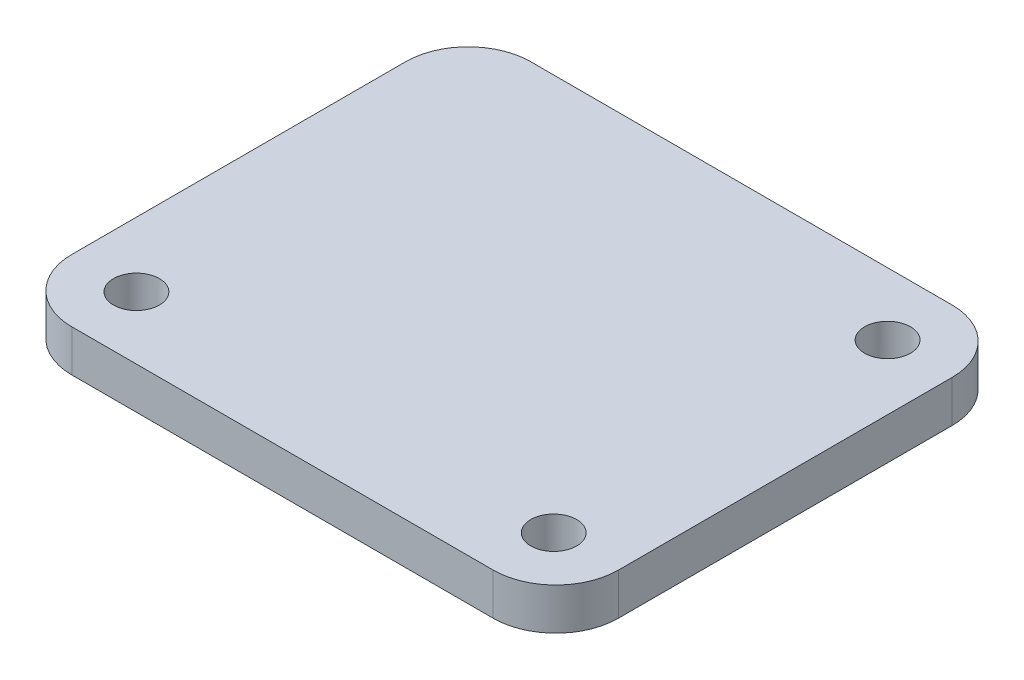
ISO-10303-21;
HEADER;
FILE_DESCRIPTION(('STEP AP214'),'2;1');
FILE_NAME('part.step','',(''),(''),'','','');
FILE_SCHEMA(('AUTOMOTIVE_DESIGN { 1 0 10303 214 1 1 1 1 }'));
ENDSEC;
DATA;
#1=APPLICATION_CONTEXT('core data for automotive mechanical design processes');
#2=APPLICATION_PROTOCOL_DEFINITION('international standard','automotive_design',2000,#1);
#3=PRODUCT_CONTEXT('',#1,'mechanical');
#4=PRODUCT('Part','Part','',(#3));
#5=PRODUCT_RELATED_PRODUCT_CATEGORY('part','',(#4));
#6=PRODUCT_DEFINITION_FORMATION('','',#4);
#7=PRODUCT_DEFINITION_CONTEXT('part definition',#1,'design');
#8=PRODUCT_DEFINITION('design','',#6,#7);
#9=PRODUCT_DEFINITION_SHAPE('','',#8);
#10=(LENGTH_UNIT() NAMED_UNIT(*) SI_UNIT(.MILLI.,.METRE.));
#11=(NAMED_UNIT(*) PLANE_ANGLE_UNIT() SI_UNIT($,.RADIAN.));
#12=(NAMED_UNIT(*) SI_UNIT($,.STERADIAN.) SOLID_ANGLE_UNIT());
#13=UNCERTAINTY_MEASURE_WITH_UNIT(LENGTH_MEASURE(1.E-05),#10,'distance_accuracy_value','');
#14=(GEOMETRIC_REPRESENTATION_CONTEXT(3) GLOBAL_UNCERTAINTY_ASSIGNED_CONTEXT((#13)) GLOBAL_UNIT_ASSIGNED_CONTEXT((#10,
#11,#12)) REPRESENTATION_CONTEXT('',''));
#15=CARTESIAN_POINT('',(0.,0.,0.));
#16=DIRECTION('',(0.,0.,1.));
#17=DIRECTION('',(1.,0.,0.));
#18=AXIS2_PLACEMENT_3D('',#15,#16,#17);
#19=CARTESIAN_POINT('',(16.637,2.54,13.97));
#20=DIRECTION('',(-1.,0.,0.));
#21=DIRECTION('',(0.,0.,1.));
#22=AXIS2_PLACEMENT_3D('',#19,#20,#21);
#23=PLANE('',#22);
#24=DIRECTION('',(0.,0.,-1.));
#25=VECTOR('',#24,1.);
#26=CARTESIAN_POINT('',(16.637,2.54,13.97));
#27=LINE('',#26,#25);
#28=CARTESIAN_POINT('',(16.637,2.54,10.16));
#29=VERTEX_POINT('',#28);
#30=CARTESIAN_POINT('',(16.637,2.54,-10.16));
#31=VERTEX_POINT('',#30);
#32=EDGE_CURVE('E131',#29,#31,#27,.T.);
#33=ORIENTED_EDGE('',*,*,#32,.F.);
#34=DIRECTION('',(0.,-1.,0.));
#35=VECTOR('',#34,1.);
#36=CARTESIAN_POINT('',(16.637,2.54,10.16));
#37=LINE('',#36,#35);
#38=CARTESIAN_POINT('',(16.637,0.,10.16));
#39=VERTEX_POINT('',#38);
#40=EDGE_CURVE('E157',#29,#39,#37,.T.);
#41=ORIENTED_EDGE('',*,*,#40,.T.);
#42=DIRECTION('',(0.,0.,-1.));
#43=VECTOR('',#42,1.);
#44=CARTESIAN_POINT('',(16.637,0.,13.97));
#45=LINE('',#44,#43);
#46=CARTESIAN_POINT('',(16.637,0.,-10.16));
#47=VERTEX_POINT('',#46);
#48=EDGE_CURVE('E163',#39,#47,#45,.T.);
#49=ORIENTED_EDGE('',*,*,#48,.T.);
#50=DIRECTION('',(0.,-1.,0.));
#51=VECTOR('',#50,1.);
#52=CARTESIAN_POINT('',(16.637,2.54,-10.16));
#53=LINE('',#52,#51);
#54=EDGE_CURVE('E155',#47,#31,#53,.F.);
#55=ORIENTED_EDGE('',*,*,#54,.T.);
#56=EDGE_LOOP('',(#33,#41,#49,#55));
#57=FACE_BOUND('',#56,.T.);
#58=ADVANCED_FACE('F39',(#57),#23,.F.);
#59=CARTESIAN_POINT('',(-16.637,2.54,-13.97));
#60=DIRECTION('',(0.,0.,1.));
#61=DIRECTION('',(1.,0.,0.));
#62=AXIS2_PLACEMENT_3D('',#59,#60,#61);
#63=PLANE('',#62);
#64=DIRECTION('',(-1.,0.,0.));
#65=VECTOR('',#64,1.);
#66=CARTESIAN_POINT('',(-16.637,2.54,-13.97));
#67=LINE('',#66,#65);
#68=CARTESIAN_POINT('',(12.827,2.54,-13.97));
#69=VERTEX_POINT('',#68);
#70=CARTESIAN_POINT('',(-12.827,2.54,-13.97));
#71=VERTEX_POINT('',#70);
#72=EDGE_CURVE('E134',#69,#71,#67,.T.);
#73=ORIENTED_EDGE('',*,*,#72,.F.);
#74=DIRECTION('',(0.,-1.,0.));
#75=VECTOR('',#74,1.);
#76=CARTESIAN_POINT('',(12.827,2.54,-13.97));
#77=LINE('',#76,#75);
#78=CARTESIAN_POINT('',(12.827,0.,-13.97));
#79=VERTEX_POINT('',#78);
#80=EDGE_CURVE('E11',#69,#79,#77,.T.);
#81=ORIENTED_EDGE('',*,*,#80,.T.);
#82=DIRECTION('',(-1.,0.,0.));
#83=VECTOR('',#82,1.);
#84=CARTESIAN_POINT('',(-16.637,0.,-13.97));
#85=LINE('',#84,#83);
#86=CARTESIAN_POINT('',(-12.827,0.,-13.97));
#87=VERTEX_POINT('',#86);
#88=EDGE_CURVE('E136',#79,#87,#85,.T.);
#89=ORIENTED_EDGE('',*,*,#88,.T.);
#90=DIRECTION('',(0.,-1.,0.));
#91=VECTOR('',#90,1.);
#92=CARTESIAN_POINT('',(-12.827,2.54,-13.97));
#93=LINE('',#92,#91);
#94=EDGE_CURVE('E47',#87,#71,#93,.F.);
#95=ORIENTED_EDGE('',*,*,#94,.T.);
#96=EDGE_LOOP('',(#73,#81,#89,#95));
#97=FACE_BOUND('',#96,.T.);
#98=ADVANCED_FACE('F211',(#97),#63,.F.);
#99=CARTESIAN_POINT('',(-16.637,2.54,13.97));
#100=DIRECTION('',(1.,0.,0.));
#101=DIRECTION('',(0.,0.,-1.));
#102=AXIS2_PLACEMENT_3D('',#99,#100,#101);
#103=PLANE('',#102);
#104=DIRECTION('',(0.,0.,1.));
#105=VECTOR('',#104,1.);
#106=CARTESIAN_POINT('',(-16.637,0.,13.97));
#107=LINE('',#106,#105);
#108=CARTESIAN_POINT('',(-16.637,0.,-10.16));
#109=VERTEX_POINT('',#108);
#110=CARTESIAN_POINT('',(-16.637,0.,10.16));
#111=VERTEX_POINT('',#110);
#112=EDGE_CURVE('E132',#109,#111,#107,.T.);
#113=ORIENTED_EDGE('',*,*,#112,.T.);
#114=DIRECTION('',(0.,-1.,0.));
#115=VECTOR('',#114,1.);
#116=CARTESIAN_POINT('',(-16.637,2.54,10.16));
#117=LINE('',#116,#115);
#118=CARTESIAN_POINT('',(-16.637,2.54,10.16));
#119=VERTEX_POINT('',#118);
#120=EDGE_CURVE('E110',#111,#119,#117,.F.);
#121=ORIENTED_EDGE('',*,*,#120,.T.);
#122=DIRECTION('',(0.,0.,1.));
#123=VECTOR('',#122,1.);
#124=CARTESIAN_POINT('',(-16.637,2.54,13.97));
#125=LINE('',#124,#123);
#126=CARTESIAN_POINT('',(-16.637,2.54,-10.16));
#127=VERTEX_POINT('',#126);
#128=EDGE_CURVE('E175',#127,#119,#125,.T.);
#129=ORIENTED_EDGE('',*,*,#128,.F.);
#130=DIRECTION('',(0.,-1.,0.));
#131=VECTOR('',#130,1.);
#132=CARTESIAN_POINT('',(-16.637,2.54,-10.16));
#133=LINE('',#132,#131);
#134=EDGE_CURVE('E115',#127,#109,#133,.T.);
#135=ORIENTED_EDGE('',*,*,#134,.T.);
#136=EDGE_LOOP('',(#113,#121,#129,#135));
#137=FACE_BOUND('',#136,.T.);
#138=ADVANCED_FACE('F216',(#137),#103,.F.);
#139=CARTESIAN_POINT('',(-16.637,2.54,13.97));
#140=DIRECTION('',(0.,0.,-1.));
#141=DIRECTION('',(-1.,0.,0.));
#142=AXIS2_PLACEMENT_3D('',#139,#140,#141);
#143=PLANE('',#142);
#144=DIRECTION('',(1.,0.,0.));
#145=VECTOR('',#144,1.);
#146=CARTESIAN_POINT('',(-16.637,2.54,13.97));
#147=LINE('',#146,#145);
#148=CARTESIAN_POINT('',(-12.827,2.54,13.97));
#149=VERTEX_POINT('',#148);
#150=CARTESIAN_POINT('',(12.827,2.54,13.97));
#151=VERTEX_POINT('',#150);
#152=EDGE_CURVE('E125',#149,#151,#147,.T.);
#153=ORIENTED_EDGE('',*,*,#152,.F.);
#154=DIRECTION('',(0.,-1.,0.));
#155=VECTOR('',#154,1.);
#156=CARTESIAN_POINT('',(-12.827,2.54,13.97));
#157=LINE('',#156,#155);
#158=CARTESIAN_POINT('',(-12.827,0.,13.97));
#159=VERTEX_POINT('',#158);
#160=EDGE_CURVE('E109',#149,#159,#157,.T.);
#161=ORIENTED_EDGE('',*,*,#160,.T.);
#162=DIRECTION('',(1.,0.,0.));
#163=VECTOR('',#162,1.);
#164=CARTESIAN_POINT('',(-16.637,0.,13.97));
#165=LINE('',#164,#163);
#166=CARTESIAN_POINT('',(12.827,0.,13.97));
#167=VERTEX_POINT('',#166);
#168=EDGE_CURVE('E122',#159,#167,#165,.T.);
#169=ORIENTED_EDGE('',*,*,#168,.T.);
#170=DIRECTION('',(0.,-1.,0.));
#171=VECTOR('',#170,1.);
#172=CARTESIAN_POINT('',(12.827,2.54,13.97));
#173=LINE('',#172,#171);
#174=EDGE_CURVE('E127',#167,#151,#173,.F.);
#175=ORIENTED_EDGE('',*,*,#174,.T.);
#176=EDGE_LOOP('',(#153,#161,#169,#175));
#177=FACE_BOUND('',#176,.T.);
#178=ADVANCED_FACE('F121',(#177),#143,.F.);
#179=CARTESIAN_POINT('',(0.,2.54,0.));
#180=DIRECTION('',(0.,-1.,0.));
#181=DIRECTION('',(0.,0.,-1.));
#182=AXIS2_PLACEMENT_3D('',#179,#180,#181);
#183=PLANE('',#182);
#184=CARTESIAN_POINT('',(12.6999999999999,2.54,-10.16));
#185=DIRECTION('',(0.,1.,0.));
#186=DIRECTION('',(0.,0.,1.));
#187=AXIS2_PLACEMENT_3D('',#184,#185,#186);
#188=CIRCLE('',#187,1.397);
#189=CARTESIAN_POINT('',(12.6999999999999,2.54,-8.763));
#190=VERTEX_POINT('',#189);
#191=EDGE_CURVE('E182',#190,#190,#188,.T.);
#192=ORIENTED_EDGE('',*,*,#191,.F.);
#193=EDGE_LOOP('',(#192));
#194=FACE_BOUND('',#193,.T.);
#195=CARTESIAN_POINT('',(-12.7,2.54,10.1600000000002));
#196=DIRECTION('',(0.,1.,0.));
#197=DIRECTION('',(0.,0.,1.));
#198=AXIS2_PLACEMENT_3D('',#195,#196,#197);
#199=CIRCLE('',#198,1.397);
#200=CARTESIAN_POINT('',(-12.7,2.54,11.5570000000002));
#201=VERTEX_POINT('',#200);
#202=EDGE_CURVE('E181',#201,#201,#199,.T.);
#203=ORIENTED_EDGE('',*,*,#202,.F.);
#204=EDGE_LOOP('',(#203));
#205=FACE_BOUND('',#204,.T.);
#206=CARTESIAN_POINT('',(12.7,2.54,10.16));
#207=DIRECTION('',(0.,1.,0.));
#208=DIRECTION('',(0.,0.,1.));
#209=AXIS2_PLACEMENT_3D('',#206,#207,#208);
#210=CIRCLE('',#209,1.397);
#211=CARTESIAN_POINT('',(12.7,2.54,11.557));
#212=VERTEX_POINT('',#211);
#213=EDGE_CURVE('E171',#212,#212,#210,.T.);
#214=ORIENTED_EDGE('',*,*,#213,.F.);
#215=EDGE_LOOP('',(#214));
#216=FACE_BOUND('',#215,.T.);
#217=ORIENTED_EDGE('',*,*,#128,.T.);
#218=CARTESIAN_POINT('',(-12.827,2.54,10.16));
#219=DIRECTION('',(0.,-1.,0.));
#220=DIRECTION('',(0.,0.,-1.));
#221=AXIS2_PLACEMENT_3D('',#218,#219,#220);
#222=CIRCLE('',#221,3.81);
#223=EDGE_CURVE('E153',#119,#149,#222,.F.);
#224=ORIENTED_EDGE('',*,*,#223,.T.);
#225=ORIENTED_EDGE('',*,*,#152,.T.);
#226=CARTESIAN_POINT('',(12.827,2.54,10.16));
#227=DIRECTION('',(0.,-1.,0.));
#228=DIRECTION('',(0.,0.,-1.));
#229=AXIS2_PLACEMENT_3D('',#226,#227,#228);
#230=CIRCLE('',#229,3.81);
#231=EDGE_CURVE('E151',#151,#29,#230,.F.);
#232=ORIENTED_EDGE('',*,*,#231,.T.);
#233=ORIENTED_EDGE('',*,*,#32,.T.);
#234=CARTESIAN_POINT('',(12.827,2.54,-10.16));
#235=DIRECTION('',(0.,-1.,0.));
#236=DIRECTION('',(0.,0.,-1.));
#237=AXIS2_PLACEMENT_3D('',#234,#235,#236);
#238=CIRCLE('',#237,3.81);
#239=EDGE_CURVE('E60',#31,#69,#238,.F.);
#240=ORIENTED_EDGE('',*,*,#239,.T.);
#241=ORIENTED_EDGE('',*,*,#72,.T.);
#242=CARTESIAN_POINT('',(-12.827,2.54,-10.16));
#243=DIRECTION('',(0.,-1.,0.));
#244=DIRECTION('',(0.,0.,-1.));
#245=AXIS2_PLACEMENT_3D('',#242,#243,#244);
#246=CIRCLE('',#245,3.81);
#247=EDGE_CURVE('E148',#71,#127,#246,.F.);
#248=ORIENTED_EDGE('',*,*,#247,.T.);
#249=EDGE_LOOP('',(#217,#224,#225,#232,#233,#240,#241,#248));
#250=FACE_BOUND('',#249,.T.);
#251=ADVANCED_FACE('F236',(#194,#205,#216,#250),#183,.F.);
#252=CARTESIAN_POINT('',(0.,0.,0.));
#253=DIRECTION('',(0.,-1.,0.));
#254=DIRECTION('',(0.,0.,-1.));
#255=AXIS2_PLACEMENT_3D('',#252,#253,#254);
#256=PLANE('',#255);
#257=CARTESIAN_POINT('',(12.6999999999999,0.,-10.16));
#258=DIRECTION('',(0.,-1.,0.));
#259=DIRECTION('',(0.,0.,-1.));
#260=AXIS2_PLACEMENT_3D('',#257,#258,#259);
#261=CIRCLE('',#260,1.397);
#262=CARTESIAN_POINT('',(12.6999999999999,0.,-11.557));
#263=VERTEX_POINT('',#262);
#264=EDGE_CURVE('E186',#263,#263,#261,.F.);
#265=ORIENTED_EDGE('',*,*,#264,.T.);
#266=EDGE_LOOP('',(#265));
#267=FACE_BOUND('',#266,.T.);
#268=CARTESIAN_POINT('',(-12.7,0.,10.1600000000002));
#269=DIRECTION('',(0.,-1.,0.));
#270=DIRECTION('',(0.,0.,-1.));
#271=AXIS2_PLACEMENT_3D('',#268,#269,#270);
#272=CIRCLE('',#271,1.397);
#273=CARTESIAN_POINT('',(-12.7,0.,8.76300000000018));
#274=VERTEX_POINT('',#273);
#275=EDGE_CURVE('E185',#274,#274,#272,.F.);
#276=ORIENTED_EDGE('',*,*,#275,.T.);
#277=EDGE_LOOP('',(#276));
#278=FACE_BOUND('',#277,.T.);
#279=CARTESIAN_POINT('',(12.7,0.,10.16));
#280=DIRECTION('',(0.,-1.,0.));
#281=DIRECTION('',(0.,0.,-1.));
#282=AXIS2_PLACEMENT_3D('',#279,#280,#281);
#283=CIRCLE('',#282,1.397);
#284=CARTESIAN_POINT('',(12.7,0.,8.763));
#285=VERTEX_POINT('',#284);
#286=EDGE_CURVE('E168',#285,#285,#283,.F.);
#287=ORIENTED_EDGE('',*,*,#286,.T.);
#288=EDGE_LOOP('',(#287));
#289=FACE_BOUND('',#288,.T.);
#290=ORIENTED_EDGE('',*,*,#168,.F.);
#291=CARTESIAN_POINT('',(-12.827,0.,10.16));
#292=DIRECTION('',(0.,-1.,0.));
#293=DIRECTION('',(0.,0.,-1.));
#294=AXIS2_PLACEMENT_3D('',#291,#292,#293);
#295=CIRCLE('',#294,3.81);
#296=EDGE_CURVE('E105',#159,#111,#295,.T.);
#297=ORIENTED_EDGE('',*,*,#296,.T.);
#298=ORIENTED_EDGE('',*,*,#112,.F.);
#299=CARTESIAN_POINT('',(-12.827,0.,-10.16));
#300=DIRECTION('',(0.,-1.,0.));
#301=DIRECTION('',(0.,0.,-1.));
#302=AXIS2_PLACEMENT_3D('',#299,#300,#301);
#303=CIRCLE('',#302,3.81);
#304=EDGE_CURVE('E126',#109,#87,#303,.T.);
#305=ORIENTED_EDGE('',*,*,#304,.T.);
#306=ORIENTED_EDGE('',*,*,#88,.F.);
#307=CARTESIAN_POINT('',(12.827,0.,-10.16));
#308=DIRECTION('',(0.,-1.,0.));
#309=DIRECTION('',(0.,0.,-1.));
#310=AXIS2_PLACEMENT_3D('',#307,#308,#309);
#311=CIRCLE('',#310,3.81);
#312=EDGE_CURVE('E142',#79,#47,#311,.T.);
#313=ORIENTED_EDGE('',*,*,#312,.T.);
#314=ORIENTED_EDGE('',*,*,#48,.F.);
#315=CARTESIAN_POINT('',(12.827,0.,10.16));
#316=DIRECTION('',(0.,-1.,0.));
#317=DIRECTION('',(0.,0.,-1.));
#318=AXIS2_PLACEMENT_3D('',#315,#316,#317);
#319=CIRCLE('',#318,3.81);
#320=EDGE_CURVE('E116',#39,#167,#319,.T.);
#321=ORIENTED_EDGE('',*,*,#320,.T.);
#322=EDGE_LOOP('',(#290,#297,#298,#305,#306,#313,#314,#321));
#323=FACE_BOUND('',#322,.T.);
#324=ADVANCED_FACE('F129',(#267,#278,#289,#323),#256,.T.);
#325=CARTESIAN_POINT('',(12.7,-3.95131269327043,10.16));
#326=DIRECTION('',(0.,1.,0.));
#327=DIRECTION('',(0.,0.,1.));
#328=AXIS2_PLACEMENT_3D('',#325,#326,#327);
#329=CYLINDRICAL_SURFACE('',#328,1.397);
#330=ORIENTED_EDGE('',*,*,#213,.T.);
#331=EDGE_LOOP('',(#330));
#332=FACE_BOUND('',#331,.T.);
#333=ORIENTED_EDGE('',*,*,#286,.F.);
#334=EDGE_LOOP('',(#333));
#335=FACE_BOUND('',#334,.T.);
#336=ADVANCED_FACE('F199',(#332,#335),#329,.F.);
#337=CARTESIAN_POINT('',(-12.7,-3.95131269327043,10.1600000000002));
#338=DIRECTION('',(0.,1.,0.));
#339=DIRECTION('',(0.,0.,1.));
#340=AXIS2_PLACEMENT_3D('',#337,#338,#339);
#341=CYLINDRICAL_SURFACE('',#340,1.397);
#342=ORIENTED_EDGE('',*,*,#202,.T.);
#343=EDGE_LOOP('',(#342));
#344=FACE_BOUND('',#343,.T.);
#345=ORIENTED_EDGE('',*,*,#275,.F.);
#346=EDGE_LOOP('',(#345));
#347=FACE_BOUND('',#346,.T.);
#348=ADVANCED_FACE('F196',(#344,#347),#341,.F.);
#349=CARTESIAN_POINT('',(12.6999999999999,-3.95131269327043,-10.16));
#350=DIRECTION('',(0.,1.,0.));
#351=DIRECTION('',(0.,0.,1.));
#352=AXIS2_PLACEMENT_3D('',#349,#350,#351);
#353=CYLINDRICAL_SURFACE('',#352,1.397);
#354=ORIENTED_EDGE('',*,*,#191,.T.);
#355=EDGE_LOOP('',(#354));
#356=FACE_BOUND('',#355,.T.);
#357=ORIENTED_EDGE('',*,*,#264,.F.);
#358=EDGE_LOOP('',(#357));
#359=FACE_BOUND('',#358,.T.);
#360=ADVANCED_FACE('F198',(#356,#359),#353,.F.);
#361=CARTESIAN_POINT('',(-12.827,2.54,10.16));
#362=DIRECTION('',(0.,-1.,0.));
#363=DIRECTION('',(0.,0.,-1.));
#364=AXIS2_PLACEMENT_3D('',#361,#362,#363);
#365=CYLINDRICAL_SURFACE('',#364,3.81);
#366=ORIENTED_EDGE('',*,*,#223,.F.);
#367=ORIENTED_EDGE('',*,*,#120,.F.);
#368=ORIENTED_EDGE('',*,*,#296,.F.);
#369=ORIENTED_EDGE('',*,*,#160,.F.);
#370=EDGE_LOOP('',(#366,#367,#368,#369));
#371=FACE_BOUND('',#370,.T.);
#372=ADVANCED_FACE('F108',(#371),#365,.T.);
#373=CARTESIAN_POINT('',(12.827,2.54,10.16));
#374=DIRECTION('',(0.,-1.,0.));
#375=DIRECTION('',(0.,0.,-1.));
#376=AXIS2_PLACEMENT_3D('',#373,#374,#375);
#377=CYLINDRICAL_SURFACE('',#376,3.81);
#378=ORIENTED_EDGE('',*,*,#231,.F.);
#379=ORIENTED_EDGE('',*,*,#174,.F.);
#380=ORIENTED_EDGE('',*,*,#320,.F.);
#381=ORIENTED_EDGE('',*,*,#40,.F.);
#382=EDGE_LOOP('',(#378,#379,#380,#381));
#383=FACE_BOUND('',#382,.T.);
#384=ADVANCED_FACE('F222',(#383),#377,.T.);
#385=CARTESIAN_POINT('',(12.827,2.54,-10.16));
#386=DIRECTION('',(0.,-1.,0.));
#387=DIRECTION('',(0.,0.,-1.));
#388=AXIS2_PLACEMENT_3D('',#385,#386,#387);
#389=CYLINDRICAL_SURFACE('',#388,3.81);
#390=ORIENTED_EDGE('',*,*,#239,.F.);
#391=ORIENTED_EDGE('',*,*,#54,.F.);
#392=ORIENTED_EDGE('',*,*,#312,.F.);
#393=ORIENTED_EDGE('',*,*,#80,.F.);
#394=EDGE_LOOP('',(#390,#391,#392,#393));
#395=FACE_BOUND('',#394,.T.);
#396=ADVANCED_FACE('F224',(#395),#389,.T.);
#397=CARTESIAN_POINT('',(-12.827,2.54,-10.16));
#398=DIRECTION('',(0.,-1.,0.));
#399=DIRECTION('',(0.,0.,-1.));
#400=AXIS2_PLACEMENT_3D('',#397,#398,#399);
#401=CYLINDRICAL_SURFACE('',#400,3.81);
#402=ORIENTED_EDGE('',*,*,#247,.F.);
#403=ORIENTED_EDGE('',*,*,#94,.F.);
#404=ORIENTED_EDGE('',*,*,#304,.F.);
#405=ORIENTED_EDGE('',*,*,#134,.F.);
#406=EDGE_LOOP('',(#402,#403,#404,#405));
#407=FACE_BOUND('',#406,.T.);
#408=ADVANCED_FACE('F41',(#407),#401,.T.);
#409=CLOSED_SHELL('',(#58,#98,#138,#178,#251,#324,#336,#348,#360,#372,#384,#396,#408));
#410=MANIFOLD_SOLID_BREP('B2',#409);
#411=ADVANCED_BREP_SHAPE_REPRESENTATION('',(#18,#410),#14);
#412=SHAPE_DEFINITION_REPRESENTATION(#9,#411);
ENDSEC;
END-ISO-10303-21;
